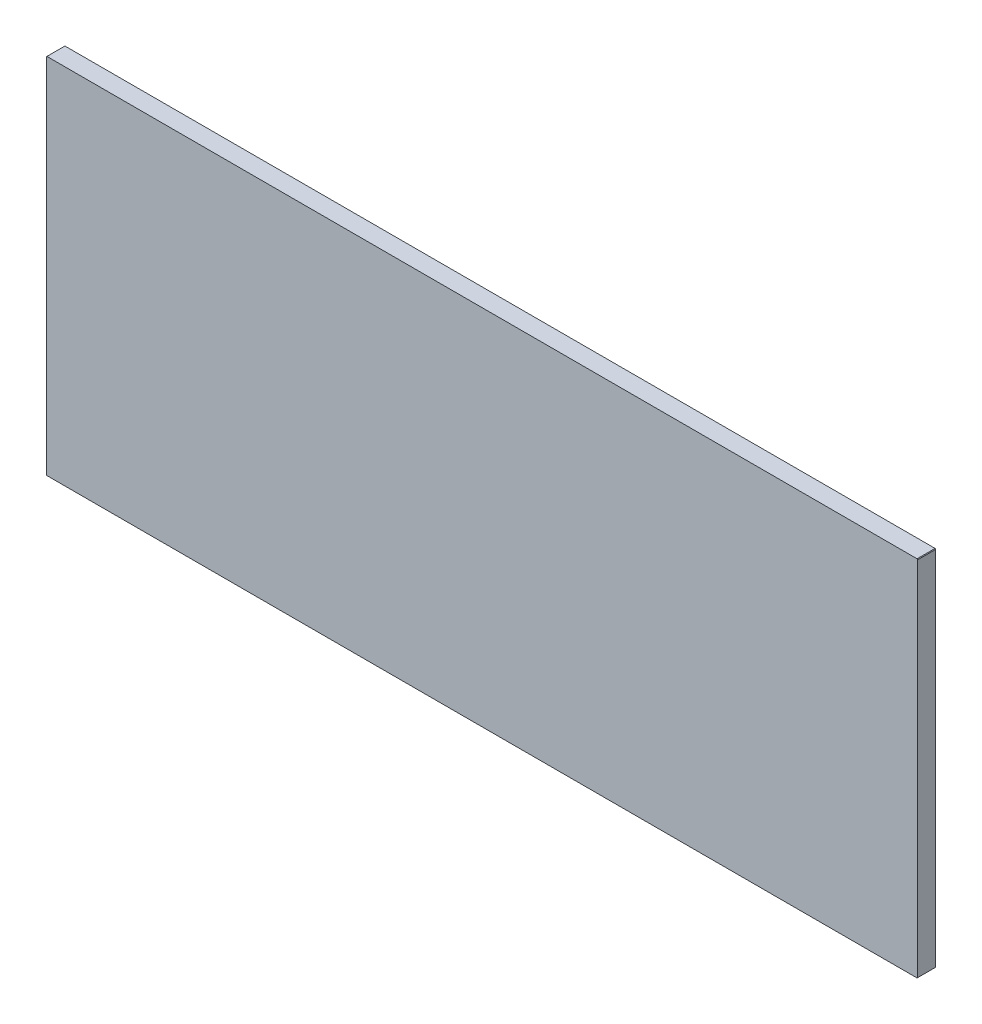
ISO-10303-21;
HEADER;
FILE_DESCRIPTION(('STEP AP214'),'2;1');
FILE_NAME('part.step','',(''),(''),'','','');
FILE_SCHEMA(('AUTOMOTIVE_DESIGN { 1 0 10303 214 1 1 1 1 }'));
ENDSEC;
DATA;
#1=APPLICATION_CONTEXT('core data for automotive mechanical design processes');
#2=APPLICATION_PROTOCOL_DEFINITION('international standard','automotive_design',2000,#1);
#3=PRODUCT_CONTEXT('',#1,'mechanical');
#4=PRODUCT('Part','Part','',(#3));
#5=PRODUCT_RELATED_PRODUCT_CATEGORY('part','',(#4));
#6=PRODUCT_DEFINITION_FORMATION('','',#4);
#7=PRODUCT_DEFINITION_CONTEXT('part definition',#1,'design');
#8=PRODUCT_DEFINITION('design','',#6,#7);
#9=PRODUCT_DEFINITION_SHAPE('','',#8);
#10=(LENGTH_UNIT() NAMED_UNIT(*) SI_UNIT(.MILLI.,.METRE.));
#11=(NAMED_UNIT(*) PLANE_ANGLE_UNIT() SI_UNIT($,.RADIAN.));
#12=(NAMED_UNIT(*) SI_UNIT($,.STERADIAN.) SOLID_ANGLE_UNIT());
#13=UNCERTAINTY_MEASURE_WITH_UNIT(LENGTH_MEASURE(1.E-05),#10,'distance_accuracy_value','');
#14=(GEOMETRIC_REPRESENTATION_CONTEXT(3) GLOBAL_UNCERTAINTY_ASSIGNED_CONTEXT((#13)) GLOBAL_UNIT_ASSIGNED_CONTEXT((#10,
#11,#12)) REPRESENTATION_CONTEXT('',''));
#15=CARTESIAN_POINT('',(0.,0.,0.));
#16=DIRECTION('',(0.,0.,1.));
#17=DIRECTION('',(1.,0.,0.));
#18=AXIS2_PLACEMENT_3D('',#15,#16,#17);
#19=CARTESIAN_POINT('',(-0.0254,15.875,0.7874));
#20=DIRECTION('',(0.,-1.,0.));
#21=DIRECTION('',(1.,0.,0.));
#22=AXIS2_PLACEMENT_3D('',#19,#20,#21);
#23=PLANE('',#22);
#24=DIRECTION('',(-1.,0.,0.));
#25=VECTOR('',#24,1.);
#26=CARTESIAN_POINT('',(-0.0254,15.875,0.));
#27=LINE('',#26,#25);
#28=CARTESIAN_POINT('',(-0.0254,15.875,0.));
#29=VERTEX_POINT('',#28);
#30=CARTESIAN_POINT('',(-38.0746,15.875,0.));
#31=VERTEX_POINT('',#30);
#32=EDGE_CURVE('E129',#29,#31,#27,.T.);
#33=ORIENTED_EDGE('',*,*,#32,.T.);
#34=DIRECTION('',(0.,0.,-1.));
#35=VECTOR('',#34,1.);
#36=CARTESIAN_POINT('',(-38.0746,15.875,0.7874));
#37=LINE('',#36,#35);
#38=CARTESIAN_POINT('',(-38.0746,15.875,0.7874));
#39=VERTEX_POINT('',#38);
#40=EDGE_CURVE('E11',#39,#31,#37,.T.);
#41=ORIENTED_EDGE('',*,*,#40,.F.);
#42=DIRECTION('',(-1.,0.,0.));
#43=VECTOR('',#42,1.);
#44=CARTESIAN_POINT('',(-0.0254,15.875,0.7874));
#45=LINE('',#44,#43);
#46=CARTESIAN_POINT('',(-0.0254,15.875,0.7874));
#47=VERTEX_POINT('',#46);
#48=EDGE_CURVE('E143',#47,#39,#45,.T.);
#49=ORIENTED_EDGE('',*,*,#48,.F.);
#50=DIRECTION('',(0.,0.,-1.));
#51=VECTOR('',#50,1.);
#52=CARTESIAN_POINT('',(-0.0254,15.875,0.7874));
#53=LINE('',#52,#51);
#54=EDGE_CURVE('E125',#47,#29,#53,.T.);
#55=ORIENTED_EDGE('',*,*,#54,.T.);
#56=EDGE_LOOP('',(#33,#41,#49,#55));
#57=FACE_BOUND('',#56,.T.);
#58=ADVANCED_FACE('F33',(#57),#23,.F.);
#59=CARTESIAN_POINT('',(-38.0746,15.875,0.7874));
#60=DIRECTION('',(0.707106781186451,-0.707106781186644,0.));
#61=DIRECTION('',(0.707106781186644,0.707106781186451,0.));
#62=AXIS2_PLACEMENT_3D('',#59,#60,#61);
#63=PLANE('',#62);
#64=DIRECTION('',(-0.707106781186644,-0.707106781186451,0.));
#65=VECTOR('',#64,1.);
#66=CARTESIAN_POINT('',(-38.0746,15.875,0.));
#67=LINE('',#66,#65);
#68=CARTESIAN_POINT('',(-38.1,15.8496,0.));
#69=VERTEX_POINT('',#68);
#70=EDGE_CURVE('E132',#31,#69,#67,.T.);
#71=ORIENTED_EDGE('',*,*,#70,.T.);
#72=DIRECTION('',(0.,0.,-1.));
#73=VECTOR('',#72,1.);
#74=CARTESIAN_POINT('',(-38.1,15.8496,0.7874));
#75=LINE('',#74,#73);
#76=CARTESIAN_POINT('',(-38.1,15.8496,0.7874));
#77=VERTEX_POINT('',#76);
#78=EDGE_CURVE('E41',#77,#69,#75,.T.);
#79=ORIENTED_EDGE('',*,*,#78,.F.);
#80=DIRECTION('',(-0.707106781186644,-0.707106781186451,0.));
#81=VECTOR('',#80,1.);
#82=CARTESIAN_POINT('',(-38.0746,15.875,0.7874));
#83=LINE('',#82,#81);
#84=EDGE_CURVE('E92',#39,#77,#83,.T.);
#85=ORIENTED_EDGE('',*,*,#84,.F.);
#86=ORIENTED_EDGE('',*,*,#40,.T.);
#87=EDGE_LOOP('',(#71,#79,#85,#86));
#88=FACE_BOUND('',#87,.T.);
#89=ADVANCED_FACE('F178',(#88),#63,.F.);
#90=CARTESIAN_POINT('',(-38.1,0.025399999999993,0.7874));
#91=DIRECTION('',(1.,0.,0.));
#92=DIRECTION('',(0.,0.,-1.));
#93=AXIS2_PLACEMENT_3D('',#90,#91,#92);
#94=PLANE('',#93);
#95=DIRECTION('',(0.,-1.,0.));
#96=VECTOR('',#95,1.);
#97=CARTESIAN_POINT('',(-38.1,0.025399999999993,0.));
#98=LINE('',#97,#96);
#99=CARTESIAN_POINT('',(-38.1,0.025399999999993,0.));
#100=VERTEX_POINT('',#99);
#101=EDGE_CURVE('E134',#69,#100,#98,.T.);
#102=ORIENTED_EDGE('',*,*,#101,.T.);
#103=DIRECTION('',(0.,0.,-1.));
#104=VECTOR('',#103,1.);
#105=CARTESIAN_POINT('',(-38.1,0.025399999999993,0.7874));
#106=LINE('',#105,#104);
#107=CARTESIAN_POINT('',(-38.1,0.025399999999993,0.7874));
#108=VERTEX_POINT('',#107);
#109=EDGE_CURVE('E150',#108,#100,#106,.T.);
#110=ORIENTED_EDGE('',*,*,#109,.F.);
#111=DIRECTION('',(0.,-1.,0.));
#112=VECTOR('',#111,1.);
#113=CARTESIAN_POINT('',(-38.1,0.025399999999993,0.7874));
#114=LINE('',#113,#112);
#115=EDGE_CURVE('E158',#77,#108,#114,.T.);
#116=ORIENTED_EDGE('',*,*,#115,.F.);
#117=ORIENTED_EDGE('',*,*,#78,.T.);
#118=EDGE_LOOP('',(#102,#110,#116,#117));
#119=FACE_BOUND('',#118,.T.);
#120=ADVANCED_FACE('F156',(#119),#94,.F.);
#121=CARTESIAN_POINT('',(-38.0746,0.,0.7874));
#122=DIRECTION('',(0.707106781186489,0.707106781186606,0.));
#123=DIRECTION('',(-0.707106781186606,0.707106781186489,0.));
#124=AXIS2_PLACEMENT_3D('',#121,#122,#123);
#125=PLANE('',#124);
#126=DIRECTION('',(0.707106781186606,-0.707106781186489,0.));
#127=VECTOR('',#126,1.);
#128=CARTESIAN_POINT('',(-38.0746,0.,0.));
#129=LINE('',#128,#127);
#130=CARTESIAN_POINT('',(-38.0746,0.,0.));
#131=VERTEX_POINT('',#130);
#132=EDGE_CURVE('E136',#100,#131,#129,.T.);
#133=ORIENTED_EDGE('',*,*,#132,.T.);
#134=DIRECTION('',(0.,0.,-1.));
#135=VECTOR('',#134,1.);
#136=CARTESIAN_POINT('',(-38.0746,0.,0.7874));
#137=LINE('',#136,#135);
#138=CARTESIAN_POINT('',(-38.0746,0.,0.7874));
#139=VERTEX_POINT('',#138);
#140=EDGE_CURVE('E147',#139,#131,#137,.T.);
#141=ORIENTED_EDGE('',*,*,#140,.F.);
#142=DIRECTION('',(0.707106781186606,-0.707106781186489,0.));
#143=VECTOR('',#142,1.);
#144=CARTESIAN_POINT('',(-38.0746,0.,0.7874));
#145=LINE('',#144,#143);
#146=EDGE_CURVE('E170',#108,#139,#145,.T.);
#147=ORIENTED_EDGE('',*,*,#146,.F.);
#148=ORIENTED_EDGE('',*,*,#109,.T.);
#149=EDGE_LOOP('',(#133,#141,#147,#148));
#150=FACE_BOUND('',#149,.T.);
#151=ADVANCED_FACE('F166',(#150),#125,.F.);
#152=CARTESIAN_POINT('',(-0.0254,0.,0.7874));
#153=DIRECTION('',(0.,1.,0.));
#154=DIRECTION('',(-1.,0.,0.));
#155=AXIS2_PLACEMENT_3D('',#152,#153,#154);
#156=PLANE('',#155);
#157=DIRECTION('',(1.,0.,0.));
#158=VECTOR('',#157,1.);
#159=CARTESIAN_POINT('',(-0.0254,0.,0.));
#160=LINE('',#159,#158);
#161=CARTESIAN_POINT('',(-0.0254,0.,0.));
#162=VERTEX_POINT('',#161);
#163=EDGE_CURVE('E138',#131,#162,#160,.T.);
#164=ORIENTED_EDGE('',*,*,#163,.T.);
#165=DIRECTION('',(0.,0.,-1.));
#166=VECTOR('',#165,1.);
#167=CARTESIAN_POINT('',(-0.0254,0.,0.7874));
#168=LINE('',#167,#166);
#169=CARTESIAN_POINT('',(-0.0254,0.,0.7874));
#170=VERTEX_POINT('',#169);
#171=EDGE_CURVE('E120',#170,#162,#168,.T.);
#172=ORIENTED_EDGE('',*,*,#171,.F.);
#173=DIRECTION('',(1.,0.,0.));
#174=VECTOR('',#173,1.);
#175=CARTESIAN_POINT('',(-0.0254,0.,0.7874));
#176=LINE('',#175,#174);
#177=EDGE_CURVE('E111',#139,#170,#176,.T.);
#178=ORIENTED_EDGE('',*,*,#177,.F.);
#179=ORIENTED_EDGE('',*,*,#140,.T.);
#180=EDGE_LOOP('',(#164,#172,#178,#179));
#181=FACE_BOUND('',#180,.T.);
#182=ADVANCED_FACE('F169',(#181),#156,.F.);
#183=CARTESIAN_POINT('',(0.,0.0254,0.7874));
#184=DIRECTION('',(-0.707106781186546,0.707106781186549,0.));
#185=DIRECTION('',(-0.707106781186549,-0.707106781186546,0.));
#186=AXIS2_PLACEMENT_3D('',#183,#184,#185);
#187=PLANE('',#186);
#188=DIRECTION('',(0.707106781186549,0.707106781186546,0.));
#189=VECTOR('',#188,1.);
#190=CARTESIAN_POINT('',(0.,0.0254,0.));
#191=LINE('',#190,#189);
#192=CARTESIAN_POINT('',(0.,0.0254,0.));
#193=VERTEX_POINT('',#192);
#194=EDGE_CURVE('E119',#162,#193,#191,.T.);
#195=ORIENTED_EDGE('',*,*,#194,.T.);
#196=DIRECTION('',(0.,0.,-1.));
#197=VECTOR('',#196,1.);
#198=CARTESIAN_POINT('',(0.,0.0254,0.7874));
#199=LINE('',#198,#197);
#200=CARTESIAN_POINT('',(0.,0.0254,0.7874));
#201=VERTEX_POINT('',#200);
#202=EDGE_CURVE('E116',#201,#193,#199,.T.);
#203=ORIENTED_EDGE('',*,*,#202,.F.);
#204=DIRECTION('',(0.707106781186549,0.707106781186546,0.));
#205=VECTOR('',#204,1.);
#206=CARTESIAN_POINT('',(0.,0.0254,0.7874));
#207=LINE('',#206,#205);
#208=EDGE_CURVE('E105',#170,#201,#207,.T.);
#209=ORIENTED_EDGE('',*,*,#208,.F.);
#210=ORIENTED_EDGE('',*,*,#171,.T.);
#211=EDGE_LOOP('',(#195,#203,#209,#210));
#212=FACE_BOUND('',#211,.T.);
#213=ADVANCED_FACE('F117',(#212),#187,.F.);
#214=CARTESIAN_POINT('',(0.,0.0254,0.7874));
#215=DIRECTION('',(-1.,0.,0.));
#216=DIRECTION('',(0.,0.,1.));
#217=AXIS2_PLACEMENT_3D('',#214,#215,#216);
#218=PLANE('',#217);
#219=DIRECTION('',(0.,1.,0.));
#220=VECTOR('',#219,1.);
#221=CARTESIAN_POINT('',(0.,0.0254,0.));
#222=LINE('',#221,#220);
#223=CARTESIAN_POINT('',(0.,15.8496,0.));
#224=VERTEX_POINT('',#223);
#225=EDGE_CURVE('E78',#193,#224,#222,.T.);
#226=ORIENTED_EDGE('',*,*,#225,.T.);
#227=DIRECTION('',(0.,0.,-1.));
#228=VECTOR('',#227,1.);
#229=CARTESIAN_POINT('',(0.,15.8496,0.7874));
#230=LINE('',#229,#228);
#231=CARTESIAN_POINT('',(0.,15.8496,0.7874));
#232=VERTEX_POINT('',#231);
#233=EDGE_CURVE('E121',#232,#224,#230,.T.);
#234=ORIENTED_EDGE('',*,*,#233,.F.);
#235=DIRECTION('',(0.,1.,0.));
#236=VECTOR('',#235,1.);
#237=CARTESIAN_POINT('',(0.,0.0254,0.7874));
#238=LINE('',#237,#236);
#239=EDGE_CURVE('E109',#201,#232,#238,.T.);
#240=ORIENTED_EDGE('',*,*,#239,.F.);
#241=ORIENTED_EDGE('',*,*,#202,.T.);
#242=EDGE_LOOP('',(#226,#234,#240,#241));
#243=FACE_BOUND('',#242,.T.);
#244=ADVANCED_FACE('F123',(#243),#218,.F.);
#245=CARTESIAN_POINT('',(0.,15.8496,0.7874));
#246=DIRECTION('',(-0.707106781186525,-0.70710678118657,0.));
#247=DIRECTION('',(0.70710678118657,-0.707106781186525,0.));
#248=AXIS2_PLACEMENT_3D('',#245,#246,#247);
#249=PLANE('',#248);
#250=DIRECTION('',(-0.70710678118657,0.707106781186525,0.));
#251=VECTOR('',#250,1.);
#252=CARTESIAN_POINT('',(0.,15.8496,0.));
#253=LINE('',#252,#251);
#254=EDGE_CURVE('E84',#224,#29,#253,.T.);
#255=ORIENTED_EDGE('',*,*,#254,.T.);
#256=ORIENTED_EDGE('',*,*,#54,.F.);
#257=DIRECTION('',(-0.70710678118657,0.707106781186525,0.));
#258=VECTOR('',#257,1.);
#259=CARTESIAN_POINT('',(0.,15.8496,0.7874));
#260=LINE('',#259,#258);
#261=EDGE_CURVE('E49',#232,#47,#260,.T.);
#262=ORIENTED_EDGE('',*,*,#261,.F.);
#263=ORIENTED_EDGE('',*,*,#233,.T.);
#264=EDGE_LOOP('',(#255,#256,#262,#263));
#265=FACE_BOUND('',#264,.T.);
#266=ADVANCED_FACE('F194',(#265),#249,.F.);
#267=CARTESIAN_POINT('',(-38.1,15.875,0.7874));
#268=DIRECTION('',(0.,0.,-1.));
#269=DIRECTION('',(-1.,0.,0.));
#270=AXIS2_PLACEMENT_3D('',#267,#268,#269);
#271=PLANE('',#270);
#272=ORIENTED_EDGE('',*,*,#48,.T.);
#273=ORIENTED_EDGE('',*,*,#84,.T.);
#274=ORIENTED_EDGE('',*,*,#115,.T.);
#275=ORIENTED_EDGE('',*,*,#146,.T.);
#276=ORIENTED_EDGE('',*,*,#177,.T.);
#277=ORIENTED_EDGE('',*,*,#208,.T.);
#278=ORIENTED_EDGE('',*,*,#239,.T.);
#279=ORIENTED_EDGE('',*,*,#261,.T.);
#280=EDGE_LOOP('',(#272,#273,#274,#275,#276,#277,#278,#279));
#281=FACE_BOUND('',#280,.T.);
#282=ADVANCED_FACE('F107',(#281),#271,.F.);
#283=CARTESIAN_POINT('',(-38.1,15.875,0.));
#284=DIRECTION('',(0.,0.,-1.));
#285=DIRECTION('',(-1.,0.,0.));
#286=AXIS2_PLACEMENT_3D('',#283,#284,#285);
#287=PLANE('',#286);
#288=ORIENTED_EDGE('',*,*,#32,.F.);
#289=ORIENTED_EDGE('',*,*,#254,.F.);
#290=ORIENTED_EDGE('',*,*,#225,.F.);
#291=ORIENTED_EDGE('',*,*,#194,.F.);
#292=ORIENTED_EDGE('',*,*,#163,.F.);
#293=ORIENTED_EDGE('',*,*,#132,.F.);
#294=ORIENTED_EDGE('',*,*,#101,.F.);
#295=ORIENTED_EDGE('',*,*,#70,.F.);
#296=EDGE_LOOP('',(#288,#289,#290,#291,#292,#293,#294,#295));
#297=FACE_BOUND('',#296,.T.);
#298=ADVANCED_FACE('F162',(#297),#287,.T.);
#299=CLOSED_SHELL('',(#58,#89,#120,#151,#182,#213,#244,#266,#282,#298));
#300=MANIFOLD_SOLID_BREP('B2',#299);
#301=ADVANCED_BREP_SHAPE_REPRESENTATION('',(#18,#300),#14);
#302=SHAPE_DEFINITION_REPRESENTATION(#9,#301);
ENDSEC;
END-ISO-10303-21;
